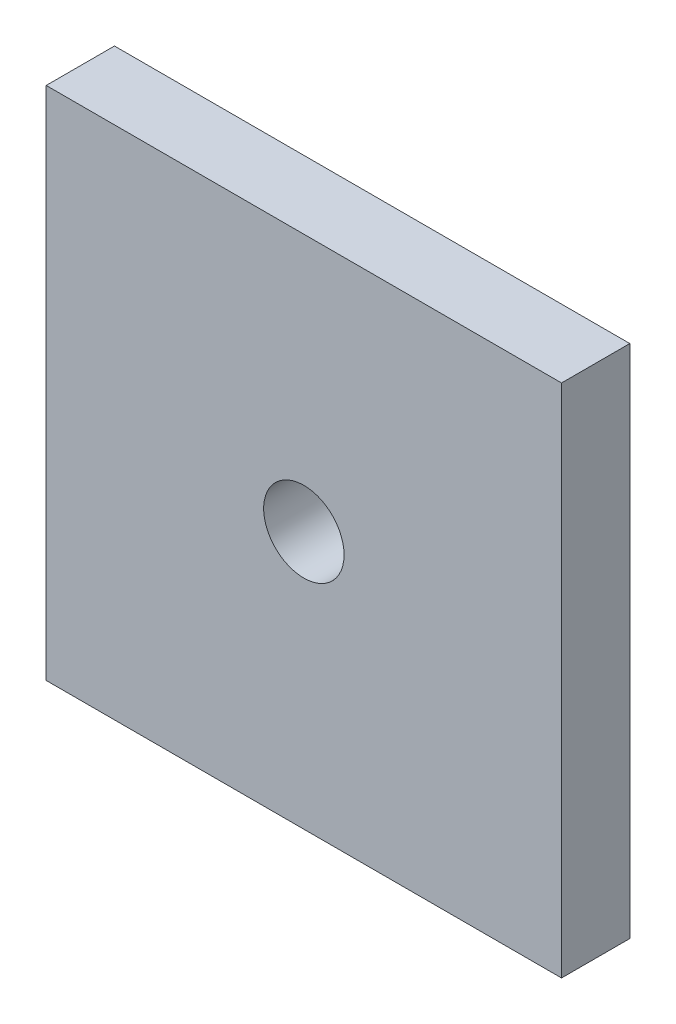
ISO-10303-21;
HEADER;
FILE_DESCRIPTION(('STEP AP214'),'2;1');
FILE_NAME('part.step','',(''),(''),'','','');
FILE_SCHEMA(('AUTOMOTIVE_DESIGN { 1 0 10303 214 1 1 1 1 }'));
ENDSEC;
DATA;
#1=APPLICATION_CONTEXT('core data for automotive mechanical design processes');
#2=APPLICATION_PROTOCOL_DEFINITION('international standard','automotive_design',2000,#1);
#3=PRODUCT_CONTEXT('',#1,'mechanical');
#4=PRODUCT('Part','Part','',(#3));
#5=PRODUCT_RELATED_PRODUCT_CATEGORY('part','',(#4));
#6=PRODUCT_DEFINITION_FORMATION('','',#4);
#7=PRODUCT_DEFINITION_CONTEXT('part definition',#1,'design');
#8=PRODUCT_DEFINITION('design','',#6,#7);
#9=PRODUCT_DEFINITION_SHAPE('','',#8);
#10=(LENGTH_UNIT() NAMED_UNIT(*) SI_UNIT(.MILLI.,.METRE.));
#11=(NAMED_UNIT(*) PLANE_ANGLE_UNIT() SI_UNIT($,.RADIAN.));
#12=(NAMED_UNIT(*) SI_UNIT($,.STERADIAN.) SOLID_ANGLE_UNIT());
#13=UNCERTAINTY_MEASURE_WITH_UNIT(LENGTH_MEASURE(1.E-05),#10,'distance_accuracy_value','');
#14=(GEOMETRIC_REPRESENTATION_CONTEXT(3) GLOBAL_UNCERTAINTY_ASSIGNED_CONTEXT((#13)) GLOBAL_UNIT_ASSIGNED_CONTEXT((#10,
#11,#12)) REPRESENTATION_CONTEXT('',''));
#15=CARTESIAN_POINT('',(0.,0.,0.));
#16=DIRECTION('',(0.,0.,1.));
#17=DIRECTION('',(1.,0.,0.));
#18=AXIS2_PLACEMENT_3D('',#15,#16,#17);
#19=CARTESIAN_POINT('',(25.4,25.4,6.731));
#20=DIRECTION('',(0.,0.,-1.));
#21=DIRECTION('',(-1.,0.,0.));
#22=AXIS2_PLACEMENT_3D('',#19,#20,#21);
#23=PLANE('',#22);
#24=DIRECTION('',(0.,1.,0.));
#25=VECTOR('',#24,1.);
#26=CARTESIAN_POINT('',(25.4,-25.4,6.731));
#27=LINE('',#26,#25);
#28=CARTESIAN_POINT('',(25.4,-25.4,6.731));
#29=VERTEX_POINT('',#28);
#30=CARTESIAN_POINT('',(25.4,25.4,6.731));
#31=VERTEX_POINT('',#30);
#32=EDGE_CURVE('E83',#29,#31,#27,.T.);
#33=ORIENTED_EDGE('',*,*,#32,.T.);
#34=DIRECTION('',(-1.,0.,0.));
#35=VECTOR('',#34,1.);
#36=CARTESIAN_POINT('',(-25.4,25.4,6.731));
#37=LINE('',#36,#35);
#38=CARTESIAN_POINT('',(-25.4,25.4,6.731));
#39=VERTEX_POINT('',#38);
#40=EDGE_CURVE('E78',#31,#39,#37,.T.);
#41=ORIENTED_EDGE('',*,*,#40,.T.);
#42=DIRECTION('',(0.,-1.,0.));
#43=VECTOR('',#42,1.);
#44=CARTESIAN_POINT('',(-25.4,-25.4,6.731));
#45=LINE('',#44,#43);
#46=CARTESIAN_POINT('',(-25.4,-25.4,6.731));
#47=VERTEX_POINT('',#46);
#48=EDGE_CURVE('E81',#39,#47,#45,.T.);
#49=ORIENTED_EDGE('',*,*,#48,.T.);
#50=DIRECTION('',(1.,0.,0.));
#51=VECTOR('',#50,1.);
#52=CARTESIAN_POINT('',(-25.4,-25.4,6.731));
#53=LINE('',#52,#51);
#54=EDGE_CURVE('E48',#47,#29,#53,.T.);
#55=ORIENTED_EDGE('',*,*,#54,.T.);
#56=EDGE_LOOP('',(#33,#41,#49,#55));
#57=FACE_BOUND('',#56,.T.);
#58=CARTESIAN_POINT('',(0.,0.,6.731));
#59=DIRECTION('',(0.,0.,1.));
#60=DIRECTION('',(1.,0.,0.));
#61=AXIS2_PLACEMENT_3D('',#58,#59,#60);
#62=CIRCLE('',#61,3.9624);
#63=CARTESIAN_POINT('',(3.96239999999999,0.,6.731));
#64=VERTEX_POINT('',#63);
#65=EDGE_CURVE('E98',#64,#64,#62,.T.);
#66=ORIENTED_EDGE('',*,*,#65,.F.);
#67=EDGE_LOOP('',(#66));
#68=FACE_BOUND('',#67,.T.);
#69=ADVANCED_FACE('F31',(#57,#68),#23,.F.);
#70=CARTESIAN_POINT('',(25.4,25.4,0.));
#71=DIRECTION('',(0.,0.,-1.));
#72=DIRECTION('',(-1.,0.,0.));
#73=AXIS2_PLACEMENT_3D('',#70,#71,#72);
#74=PLANE('',#73);
#75=DIRECTION('',(0.,1.,0.));
#76=VECTOR('',#75,1.);
#77=CARTESIAN_POINT('',(25.4,-25.4,0.));
#78=LINE('',#77,#76);
#79=CARTESIAN_POINT('',(25.4,-25.4,0.));
#80=VERTEX_POINT('',#79);
#81=CARTESIAN_POINT('',(25.4,25.4,0.));
#82=VERTEX_POINT('',#81);
#83=EDGE_CURVE('E95',#80,#82,#78,.T.);
#84=ORIENTED_EDGE('',*,*,#83,.F.);
#85=DIRECTION('',(1.,0.,0.));
#86=VECTOR('',#85,1.);
#87=CARTESIAN_POINT('',(-25.4,-25.4,0.));
#88=LINE('',#87,#86);
#89=CARTESIAN_POINT('',(-25.4,-25.4,0.));
#90=VERTEX_POINT('',#89);
#91=EDGE_CURVE('E71',#90,#80,#88,.T.);
#92=ORIENTED_EDGE('',*,*,#91,.F.);
#93=DIRECTION('',(0.,-1.,0.));
#94=VECTOR('',#93,1.);
#95=CARTESIAN_POINT('',(-25.4,-25.4,0.));
#96=LINE('',#95,#94);
#97=CARTESIAN_POINT('',(-25.4,25.4,0.));
#98=VERTEX_POINT('',#97);
#99=EDGE_CURVE('E65',#98,#90,#96,.T.);
#100=ORIENTED_EDGE('',*,*,#99,.F.);
#101=DIRECTION('',(-1.,0.,0.));
#102=VECTOR('',#101,1.);
#103=CARTESIAN_POINT('',(-25.4,25.4,0.));
#104=LINE('',#103,#102);
#105=EDGE_CURVE('E87',#82,#98,#104,.T.);
#106=ORIENTED_EDGE('',*,*,#105,.F.);
#107=EDGE_LOOP('',(#84,#92,#100,#106));
#108=FACE_BOUND('',#107,.T.);
#109=CARTESIAN_POINT('',(0.,0.,0.));
#110=DIRECTION('',(0.,0.,1.));
#111=DIRECTION('',(1.,0.,0.));
#112=AXIS2_PLACEMENT_3D('',#109,#110,#111);
#113=CIRCLE('',#112,3.9624);
#114=CARTESIAN_POINT('',(3.96239999999999,0.,0.));
#115=VERTEX_POINT('',#114);
#116=EDGE_CURVE('E110',#115,#115,#113,.T.);
#117=ORIENTED_EDGE('',*,*,#116,.T.);
#118=EDGE_LOOP('',(#117));
#119=FACE_BOUND('',#118,.T.);
#120=ADVANCED_FACE('F106',(#108,#119),#74,.T.);
#121=CARTESIAN_POINT('',(25.4,-25.4,6.731));
#122=DIRECTION('',(-1.,0.,0.));
#123=DIRECTION('',(0.,0.,1.));
#124=AXIS2_PLACEMENT_3D('',#121,#122,#123);
#125=PLANE('',#124);
#126=ORIENTED_EDGE('',*,*,#83,.T.);
#127=DIRECTION('',(0.,0.,-1.));
#128=VECTOR('',#127,1.);
#129=CARTESIAN_POINT('',(25.4,25.4,6.731));
#130=LINE('',#129,#128);
#131=EDGE_CURVE('E11',#31,#82,#130,.T.);
#132=ORIENTED_EDGE('',*,*,#131,.F.);
#133=ORIENTED_EDGE('',*,*,#32,.F.);
#134=DIRECTION('',(0.,0.,-1.));
#135=VECTOR('',#134,1.);
#136=CARTESIAN_POINT('',(25.4,-25.4,6.731));
#137=LINE('',#136,#135);
#138=EDGE_CURVE('E91',#29,#80,#137,.T.);
#139=ORIENTED_EDGE('',*,*,#138,.T.);
#140=EDGE_LOOP('',(#126,#132,#133,#139));
#141=FACE_BOUND('',#140,.T.);
#142=ADVANCED_FACE('F33',(#141),#125,.F.);
#143=CARTESIAN_POINT('',(-25.4,25.4,6.731));
#144=DIRECTION('',(0.,-1.,0.));
#145=DIRECTION('',(0.,0.,-1.));
#146=AXIS2_PLACEMENT_3D('',#143,#144,#145);
#147=PLANE('',#146);
#148=ORIENTED_EDGE('',*,*,#105,.T.);
#149=DIRECTION('',(0.,0.,-1.));
#150=VECTOR('',#149,1.);
#151=CARTESIAN_POINT('',(-25.4,25.4,6.731));
#152=LINE('',#151,#150);
#153=EDGE_CURVE('E40',#39,#98,#152,.T.);
#154=ORIENTED_EDGE('',*,*,#153,.F.);
#155=ORIENTED_EDGE('',*,*,#40,.F.);
#156=ORIENTED_EDGE('',*,*,#131,.T.);
#157=EDGE_LOOP('',(#148,#154,#155,#156));
#158=FACE_BOUND('',#157,.T.);
#159=ADVANCED_FACE('F86',(#158),#147,.F.);
#160=CARTESIAN_POINT('',(-25.4,-25.4,6.731));
#161=DIRECTION('',(1.,0.,0.));
#162=DIRECTION('',(0.,0.,-1.));
#163=AXIS2_PLACEMENT_3D('',#160,#161,#162);
#164=PLANE('',#163);
#165=ORIENTED_EDGE('',*,*,#99,.T.);
#166=DIRECTION('',(0.,0.,-1.));
#167=VECTOR('',#166,1.);
#168=CARTESIAN_POINT('',(-25.4,-25.4,6.731));
#169=LINE('',#168,#167);
#170=EDGE_CURVE('E88',#47,#90,#169,.T.);
#171=ORIENTED_EDGE('',*,*,#170,.F.);
#172=ORIENTED_EDGE('',*,*,#48,.F.);
#173=ORIENTED_EDGE('',*,*,#153,.T.);
#174=EDGE_LOOP('',(#165,#171,#172,#173));
#175=FACE_BOUND('',#174,.T.);
#176=ADVANCED_FACE('F89',(#175),#164,.F.);
#177=CARTESIAN_POINT('',(-25.4,-25.4,6.731));
#178=DIRECTION('',(0.,1.,0.));
#179=DIRECTION('',(0.,0.,1.));
#180=AXIS2_PLACEMENT_3D('',#177,#178,#179);
#181=PLANE('',#180);
#182=ORIENTED_EDGE('',*,*,#91,.T.);
#183=ORIENTED_EDGE('',*,*,#138,.F.);
#184=ORIENTED_EDGE('',*,*,#54,.F.);
#185=ORIENTED_EDGE('',*,*,#170,.T.);
#186=EDGE_LOOP('',(#182,#183,#184,#185));
#187=FACE_BOUND('',#186,.T.);
#188=ADVANCED_FACE('F103',(#187),#181,.F.);
#189=CARTESIAN_POINT('',(0.,0.,6.731));
#190=DIRECTION('',(0.,0.,-1.));
#191=DIRECTION('',(-1.,0.,0.));
#192=AXIS2_PLACEMENT_3D('',#189,#190,#191);
#193=CYLINDRICAL_SURFACE('',#192,3.9624);
#194=ORIENTED_EDGE('',*,*,#65,.T.);
#195=EDGE_LOOP('',(#194));
#196=FACE_BOUND('',#195,.T.);
#197=ORIENTED_EDGE('',*,*,#116,.F.);
#198=EDGE_LOOP('',(#197));
#199=FACE_BOUND('',#198,.T.);
#200=ADVANCED_FACE('F116',(#196,#199),#193,.F.);
#201=CLOSED_SHELL('',(#69,#120,#142,#159,#176,#188,#200));
#202=MANIFOLD_SOLID_BREP('B2',#201);
#203=ADVANCED_BREP_SHAPE_REPRESENTATION('',(#18,#202),#14);
#204=SHAPE_DEFINITION_REPRESENTATION(#9,#203);
ENDSEC;
END-ISO-10303-21;
